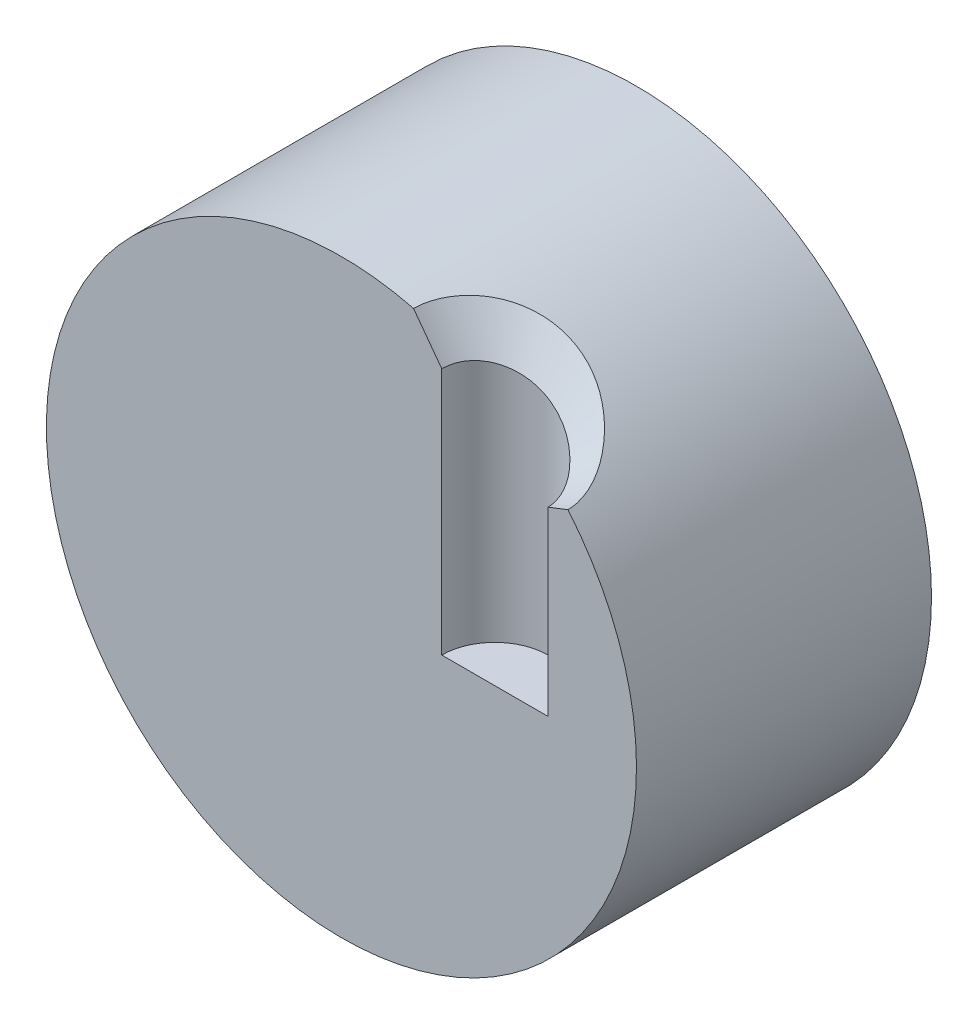
ISO-10303-21;
HEADER;
FILE_DESCRIPTION(('STEP AP214'),'2;1');
FILE_NAME('part.step','',(''),(''),'','','');
FILE_SCHEMA(('AUTOMOTIVE_DESIGN { 1 0 10303 214 1 1 1 1 }'));
ENDSEC;
DATA;
#1=APPLICATION_CONTEXT('core data for automotive mechanical design processes');
#2=APPLICATION_PROTOCOL_DEFINITION('international standard','automotive_design',2000,#1);
#3=PRODUCT_CONTEXT('',#1,'mechanical');
#4=PRODUCT('Part','Part','',(#3));
#5=PRODUCT_RELATED_PRODUCT_CATEGORY('part','',(#4));
#6=PRODUCT_DEFINITION_FORMATION('','',#4);
#7=PRODUCT_DEFINITION_CONTEXT('part definition',#1,'design');
#8=PRODUCT_DEFINITION('design','',#6,#7);
#9=PRODUCT_DEFINITION_SHAPE('','',#8);
#10=(LENGTH_UNIT() NAMED_UNIT(*) SI_UNIT(.MILLI.,.METRE.));
#11=(NAMED_UNIT(*) PLANE_ANGLE_UNIT() SI_UNIT($,.RADIAN.));
#12=(NAMED_UNIT(*) SI_UNIT($,.STERADIAN.) SOLID_ANGLE_UNIT());
#13=UNCERTAINTY_MEASURE_WITH_UNIT(LENGTH_MEASURE(1.E-05),#10,'distance_accuracy_value','');
#14=(GEOMETRIC_REPRESENTATION_CONTEXT(3) GLOBAL_UNCERTAINTY_ASSIGNED_CONTEXT((#13)) GLOBAL_UNIT_ASSIGNED_CONTEXT((#10,
#11,#12)) REPRESENTATION_CONTEXT('',''));
#15=CARTESIAN_POINT('',(0.,0.,0.));
#16=DIRECTION('',(0.,0.,1.));
#17=DIRECTION('',(1.,0.,0.));
#18=AXIS2_PLACEMENT_3D('',#15,#16,#17);
#19=CARTESIAN_POINT('',(13.,50.,0.));
#20=DIRECTION('',(0.,-1.,0.));
#21=DIRECTION('',(0.,0.,-1.));
#22=AXIS2_PLACEMENT_3D('',#19,#20,#21);
#23=CYLINDRICAL_SURFACE('',#22,4.5);
#24=CARTESIAN_POINT('',(8.5,21.0106358910175,0.));
#25=CARTESIAN_POINT('',(8.50000000000001,21.0106358910175,-1.28612390350236));
#26=CARTESIAN_POINT('',(9.09323816529307,20.8094444949196,-2.55154337069353));
#27=CARTESIAN_POINT('',(10.8831303615547,20.0266486269932,-4.13590484872952));
#28=CARTESIAN_POINT('',(12.0398328297088,19.4431002105504,-4.51627222838368));
#29=CARTESIAN_POINT('',(14.239533742647,18.0939172948029,-4.47921359309723));
#30=CARTESIAN_POINT('',(15.830108523265,16.89937483969,-3.79497795565792));
#31=CARTESIAN_POINT('',(17.2061424276833,15.6462471624592,-1.9249997936301));
#32=CARTESIAN_POINT('',(17.5,15.3535710713571,-0.649140939737382));
#33=CARTESIAN_POINT('',(17.5,15.3535710713571,0.));
#34=B_SPLINE_CURVE_WITH_KNOTS('',3,(#24,#25,#26,#27,#28,#29,#30,#31,#32,#33),.UNSPECIFIED.,.F.,
.F.,(4,2,1,1,1,1,4),(0.,0.25,0.484211028592382,0.5,0.75,0.875,1.),.UNSPECIFIED.);
#35=CARTESIAN_POINT('',(13.2310791262327,18.711738496122,-4.49406302107787));
#36=VERTEX_POINT('',#35);
#37=CARTESIAN_POINT('',(17.1957301892497,15.6468289441255,-1.62660633806063));
#38=VERTEX_POINT('',#37);
#39=EDGE_CURVE('E216',#36,#38,#34,.T.);
#40=ORIENTED_EDGE('',*,*,#39,.F.);
#41=CARTESIAN_POINT('',(10.0173851670386,20.4052757657333,-3.36957191592992));
#42=CARTESIAN_POINT('',(10.0755083043557,20.3798564706132,-3.4210259435045));
#43=CARTESIAN_POINT('',(10.1347708732192,20.3536309481129,-3.47078720699877));
#44=CARTESIAN_POINT('',(10.2550931805986,20.2997573582393,-3.56665058730731));
#45=CARTESIAN_POINT('',(10.3161439650753,20.2721159858622,-3.61276770065865));
#46=CARTESIAN_POINT('',(10.4398815347203,20.2154647147495,-3.7013826457049));
#47=CARTESIAN_POINT('',(10.502562737756,20.1864592658293,-3.74389112774458));
#48=CARTESIAN_POINT('',(10.6294001316143,20.1271346258118,-3.82533535987878));
#49=CARTESIAN_POINT('',(10.6935531916576,20.0968181202529,-3.86427794726195));
#50=CARTESIAN_POINT('',(10.8231745275909,20.0349240889016,-3.93863263739004));
#51=CARTESIAN_POINT('',(10.8886413571122,20.0033479157285,-3.97404839151366));
#52=CARTESIAN_POINT('',(11.0207318560443,19.9389904458922,-4.04139540063046));
#53=CARTESIAN_POINT('',(11.0873551525855,19.9062095339892,-4.07332775541628));
#54=CARTESIAN_POINT('',(11.2215986027736,19.8394838295998,-4.13373588191841));
#55=CARTESIAN_POINT('',(11.2892189909684,19.8055387606938,-4.16221082531068));
#56=CARTESIAN_POINT('',(11.4253056194733,19.7365777135972,-4.21579281812949));
#57=CARTESIAN_POINT('',(11.4937723680266,19.7015610712394,-4.2408977246567));
#58=CARTESIAN_POINT('',(11.6130142426524,19.6398527594388,-4.28136590214168));
#59=CARTESIAN_POINT('',(11.663650318488,19.6134246084789,-4.29754401183038));
#60=CARTESIAN_POINT('',(11.7704614870806,19.557108761143,-4.32951338380665));
#61=CARTESIAN_POINT('',(11.8266630170407,19.5271479117159,-4.34508797654452));
#62=CARTESIAN_POINT('',(11.9446048822233,19.463641007705,-4.37529760440365));
#63=CARTESIAN_POINT('',(12.0063655744598,19.4300241861386,-4.38970387675811));
#64=CARTESIAN_POINT('',(12.1353759048221,19.3590423674519,-4.41693532781115));
#65=CARTESIAN_POINT('',(12.2026374703481,19.3216049842288,-4.42951535743564));
#66=CARTESIAN_POINT('',(12.3425428002979,19.2428366177202,-4.45242421922151));
#67=CARTESIAN_POINT('',(12.4151881881585,19.2014331536605,-4.46249365267962));
#68=CARTESIAN_POINT('',(12.5656831040575,19.1145933185181,-4.47966804780186));
#69=CARTESIAN_POINT('',(12.6435219482707,19.0690844782845,-4.48650012365));
#70=CARTESIAN_POINT('',(12.8041404697004,18.973911240747,-4.49645381236572));
#71=CARTESIAN_POINT('',(12.8868952114306,18.9241750539192,-4.49929071416994));
#72=CARTESIAN_POINT('',(13.0569836615445,18.8204416463148,-4.50047298291389));
#73=CARTESIAN_POINT('',(13.1442764330653,18.7663737125257,-4.49852333076545));
#74=CARTESIAN_POINT('',(13.2310791262323,18.7117384961222,-4.49406302107789));
#75=B_SPLINE_CURVE_WITH_KNOTS('',3,(#41,#42,#43,#44,#45,#46,#47,#48,#49,#50,#51,#52,#53,#54,#55,
#56,#57,#58,#59,#60,#61,#62,#63,#64,#65,#66,#67,#68,#69,#70,#71,#72,#73,#74),.UNSPECIFIED.,.F.,
.F.,(4,2,2,2,2,2,2,2,2,2,2,2,2,2,2,2,4),(0.,0.245009998115187,0.48895261866808,
0.732148251007908,0.974867360236699,1.21733250790367,1.45972088059012,1.70216721039607,
1.94476698115417,2.12282759160317,2.31947544240834,2.53475152249334,2.76868031461934,
3.02125701162944,3.29243215550944,3.58209442637968,3.8900527707573),.UNSPECIFIED.);
#76=CARTESIAN_POINT('',(10.0173853682608,20.40527567773,-3.36957209404402));
#77=VERTEX_POINT('',#76);
#78=EDGE_CURVE('E208',#77,#36,#75,.T.);
#79=ORIENTED_EDGE('',*,*,#78,.F.);
#80=CARTESIAN_POINT('',(8.5,21.0106358910175,0.));
#81=CARTESIAN_POINT('',(8.49998399260202,21.0106468391827,-0.11973073962423));
#82=CARTESIAN_POINT('',(8.50477785666777,21.0093836784554,-0.239469893160919));
#83=CARTESIAN_POINT('',(8.52387610143971,21.0038977215626,-0.478130405595921));
#84=CARTESIAN_POINT('',(8.53818147182403,20.9996746174107,-0.597051678092112));
#85=CARTESIAN_POINT('',(8.5761550767947,20.987869115546,-0.832978059064181));
#86=CARTESIAN_POINT('',(8.59980434419083,20.9802935193446,-0.949986552309926));
#87=CARTESIAN_POINT('',(8.6562327972585,20.9614744719834,-1.18147152347752));
#88=CARTESIAN_POINT('',(8.68901128635605,20.9502313006541,-1.29594819386239));
#89=CARTESIAN_POINT('',(8.76341637309469,20.9238455119036,-1.52167617842173));
#90=CARTESIAN_POINT('',(8.80505316493573,20.9086983975129,-1.63292360728982));
#91=CARTESIAN_POINT('',(8.89674724092273,20.8744013672264,-1.85130995246987));
#92=CARTESIAN_POINT('',(8.9468082289252,20.8552496897465,-1.95844703603639));
#93=CARTESIAN_POINT('',(9.05482919337047,20.8129671119953,-2.16783410751081));
#94=CARTESIAN_POINT('',(9.11278884496336,20.7898363753612,-2.27008429616954));
#95=CARTESIAN_POINT('',(9.23601429354331,20.739747281541,-2.4690281298699));
#96=CARTESIAN_POINT('',(9.30127721084513,20.712790431878,-2.56572394240742));
#97=CARTESIAN_POINT('',(9.4386776966942,20.6552348362701,-2.75327458148697));
#98=CARTESIAN_POINT('',(9.51082864628252,20.6246289716471,-2.84411744018745));
#99=CARTESIAN_POINT('',(9.62365061380806,20.5762979037097,-2.97550015745759));
#100=CARTESIAN_POINT('',(9.66202811758913,20.5597819804249,-3.0184850448958));
#101=CARTESIAN_POINT('',(9.74025305072158,20.5259941840628,-3.10279800836146));
#102=CARTESIAN_POINT('',(9.780100564965,20.5087222673165,-3.14412598841519));
#103=CARTESIAN_POINT('',(9.86119356565619,20.4734648813318,-3.22508586764697));
#104=CARTESIAN_POINT('',(9.90243932510759,20.4554792726286,-3.26471743214671));
#105=CARTESIAN_POINT('',(9.98626358870742,20.4189030916701,-3.34225221572577));
#106=CARTESIAN_POINT('',(10.0288420561388,20.4003125360809,-3.38015548235034));
#107=CARTESIAN_POINT('',(10.1151852743153,20.3622793067808,-3.45413922157425));
#108=CARTESIAN_POINT('',(10.1589499946799,20.3428366548846,-3.49021974078728));
#109=CARTESIAN_POINT('',(10.2475792287077,20.3031396516976,-3.56053090517776));
#110=CARTESIAN_POINT('',(10.2924437638527,20.2828852845473,-3.59476151418076));
#111=CARTESIAN_POINT('',(10.4357744384048,20.2176596707381,-3.69993254387023));
#112=CARTESIAN_POINT('',(10.5361204305972,20.1712394831024,-3.76745630690658));
#113=CARTESIAN_POINT('',(10.7406879799205,20.074977734583,-3.89357895041721));
#114=CARTESIAN_POINT('',(10.8449099597115,20.0251358000679,-3.95217685399305));
#115=CARTESIAN_POINT('',(11.0564531084448,19.9222020688464,-4.06038673686003));
#116=CARTESIAN_POINT('',(11.1637757877948,19.8691086736988,-4.10999424818849));
#117=CARTESIAN_POINT('',(11.380620783624,19.7599061342607,-4.20016850257938));
#118=CARTESIAN_POINT('',(11.4901430649871,19.7037970380914,-4.24073538984873));
#119=CARTESIAN_POINT('',(11.839173330694,19.5216488424265,-4.35493942336512));
#120=CARTESIAN_POINT('',(12.0814932206612,19.3902818450779,-4.41205726917491));
#121=CARTESIAN_POINT('',(12.5654472260888,19.1164547952843,-4.48565197257035));
#122=CARTESIAN_POINT('',(12.807081816572,18.9740083596239,-4.50217792870442));
#123=CARTESIAN_POINT('',(13.1076264048146,18.7890146835537,-4.49914250445915));
#124=CARTESIAN_POINT('',(13.1694861361662,18.7505123226203,-4.49723263669623));
#125=CARTESIAN_POINT('',(13.2310791262323,18.7117384961222,-4.49406302107788));
#126=B_SPLINE_CURVE_WITH_KNOTS('',3,(#80,#81,#82,#83,#84,#85,#86,#87,#88,#89,#90,#91,#92,#93,
#94,#95,#96,#97,#98,#99,#100,#101,#102,#103,#104,#105,#106,#107,#108,#109,#110,#111,#112,#113,
#114,#115,#116,#117,#118,#119,#120,#121,#122,#123,#124,#125),.UNSPECIFIED.,.F.,.F.,(4,2,2,2,2,2,
2,2,2,2,2,2,2,2,2,2,2,2,2,2,2,2,4),(0.,0.359102074999249,0.718241520640057,1.07665566346091,
1.43504246620682,1.79384395587221,2.15280361352559,2.51174851262697,2.87055237478457,
3.23006802920722,3.40986349727187,3.58966936469852,3.76951054325441,3.94934677141447,
4.12917839823574,4.30901354034173,4.69720167658858,5.08543226794369,5.47385527263958,
5.86227208115898,6.70311708582155,7.54294453144893,7.76155252910822),.UNSPECIFIED.);
#127=CARTESIAN_POINT('',(8.5,21.0106358910175,0.));
#128=VERTEX_POINT('',#127);
#129=EDGE_CURVE('E13',#128,#77,#126,.T.);
#130=ORIENTED_EDGE('',*,*,#129,.F.);
#131=DIRECTION('',(0.,-1.,0.));
#132=VECTOR('',#131,1.);
#133=CARTESIAN_POINT('',(8.5,50.,0.));
#134=LINE('',#133,#132);
#135=CARTESIAN_POINT('',(8.5,0.,0.));
#136=VERTEX_POINT('',#135);
#137=EDGE_CURVE('E257',#128,#136,#134,.T.);
#138=ORIENTED_EDGE('',*,*,#137,.T.);
#139=CARTESIAN_POINT('',(13.,0.,0.));
#140=DIRECTION('',(0.,1.,0.));
#141=DIRECTION('',(0.,0.,1.));
#142=AXIS2_PLACEMENT_3D('',#139,#140,#141);
#143=CIRCLE('',#142,4.5);
#144=CARTESIAN_POINT('',(17.5,0.,0.));
#145=VERTEX_POINT('',#144);
#146=EDGE_CURVE('E361',#145,#136,#143,.T.);
#147=ORIENTED_EDGE('',*,*,#146,.F.);
#148=DIRECTION('',(0.,-1.,0.));
#149=VECTOR('',#148,1.);
#150=CARTESIAN_POINT('',(17.5,50.,0.));
#151=LINE('',#150,#149);
#152=CARTESIAN_POINT('',(17.5,15.3535710713571,0.));
#153=VERTEX_POINT('',#152);
#154=EDGE_CURVE('E261',#145,#153,#151,.F.);
#155=ORIENTED_EDGE('',*,*,#154,.T.);
#156=CARTESIAN_POINT('',(17.1957301892497,15.6468289441255,-1.62660633806063));
#157=CARTESIAN_POINT('',(17.2199692276056,15.624237397282,-1.56407854827776));
#158=CARTESIAN_POINT('',(17.2429246923163,15.6027296339733,-1.50065721717568));
#159=CARTESIAN_POINT('',(17.286161509033,15.5620279199958,-1.37216155193047));
#160=CARTESIAN_POINT('',(17.3064421272423,15.5428346043782,-1.30708677000743));
#161=CARTESIAN_POINT('',(17.3442019998283,15.5069271196166,-1.17547670027731));
#162=CARTESIAN_POINT('',(17.3616822736876,15.4902120484185,-1.10894195405486));
#163=CARTESIAN_POINT('',(17.3857053167463,15.4671235586315,-1.00818876026128));
#164=CARTESIAN_POINT('',(17.3933454354469,15.4597593813502,-0.974452827561098));
#165=CARTESIAN_POINT('',(17.4078767354709,15.4457136269567,-0.90669188594628));
#166=CARTESIAN_POINT('',(17.4147682070095,15.4390317853957,-0.872666994601989));
#167=CARTESIAN_POINT('',(17.4277859037594,15.4263717435,-0.804354573325884));
#168=CARTESIAN_POINT('',(17.4339124103298,15.4203932845036,-0.770067144910864));
#169=CARTESIAN_POINT('',(17.4453843834517,15.4091605530476,-0.701254456202856));
#170=CARTESIAN_POINT('',(17.4507300837489,15.4039060638838,-0.666729270340354));
#171=CARTESIAN_POINT('',(17.4606246092194,15.394141850186,-0.597466324032974));
#172=CARTESIAN_POINT('',(17.4651735770027,15.389631992376,-0.562728602784988));
#173=CARTESIAN_POINT('',(17.4734589199193,15.3813774989722,-0.493065733176739));
#174=CARTESIAN_POINT('',(17.4771952978661,15.377632860729,-0.458140585465829));
#175=CARTESIAN_POINT('',(17.4838398157081,15.3709291854552,-0.388128030070211));
#176=CARTESIAN_POINT('',(17.4867477648949,15.3679703293264,-0.35304058691041));
#177=CARTESIAN_POINT('',(17.4917199095224,15.3628584603017,-0.282728631691373));
#178=CARTESIAN_POINT('',(17.4937836621396,15.3607058703829,-0.247504057454272));
#179=CARTESIAN_POINT('',(17.4970518769583,15.3572267865825,-0.176942863862906));
#180=CARTESIAN_POINT('',(17.4982555810435,15.3559010216619,-0.141606173166986));
#181=CARTESIAN_POINT('',(17.4997887197646,15.3540952752404,-0.0708463127006203));
#182=CARTESIAN_POINT('',(17.5001170145696,15.3536163967048,-0.0354230902341227));
#183=CARTESIAN_POINT('',(17.5,15.3535710713571,0.));
#184=B_SPLINE_CURVE_WITH_KNOTS('',3,(#156,#157,#158,#159,#160,#161,#162,#163,#164,#165,#166,
#167,#168,#169,#170,#171,#172,#173,#174,#175,#176,#177,#178,#179,#180,#181,#182,#183),
.UNSPECIFIED.,.F.,.F.,(4,2,2,2,2,2,2,2,2,2,2,2,2,4),(0.,0.212272963286814,0.424604039322181,
0.636857638395131,0.742941173471469,0.848983437092724,0.954986582066547,1.06095792812559,
1.16691028655403,1.27286227813864,1.37883864073862,1.48487052220075,1.59099575380801,
1.69725909897306),.UNSPECIFIED.);
#185=EDGE_CURVE('E316',#38,#153,#184,.T.);
#186=ORIENTED_EDGE('',*,*,#185,.F.);
#187=EDGE_LOOP('',(#40,#79,#130,#138,#147,#155,#186));
#188=FACE_BOUND('',#187,.T.);
#189=ADVANCED_FACE('F199',(#188),#23,.F.);
#190=CARTESIAN_POINT('',(0.,0.,0.));
#191=DIRECTION('',(0.,0.,1.));
#192=DIRECTION('',(1.,0.,0.));
#193=AXIS2_PLACEMENT_3D('',#190,#191,#192);
#194=PLANE('',#193);
#195=DIRECTION('',(0.931351597030646,0.364121137409607,0.));
#196=VECTOR('',#195,1.);
#197=CARTESIAN_POINT('',(17.5,15.3535710713571,0.));
#198=LINE('',#197,#196);
#199=CARTESIAN_POINT('',(19.1956240141954,16.0164920848995,0.));
#200=VERTEX_POINT('',#199);
#201=EDGE_CURVE('E325',#153,#200,#198,.T.);
#202=ORIENTED_EDGE('',*,*,#201,.F.);
#203=ORIENTED_EDGE('',*,*,#154,.F.);
#204=DIRECTION('',(1.,0.,0.));
#205=VECTOR('',#204,1.);
#206=CARTESIAN_POINT('',(13.,0.,0.));
#207=LINE('',#206,#205);
#208=EDGE_CURVE('E224',#136,#145,#207,.T.);
#209=ORIENTED_EDGE('',*,*,#208,.F.);
#210=ORIENTED_EDGE('',*,*,#137,.F.);
#211=DIRECTION('',(0.594746390379792,-0.803913385340864,0.));
#212=VECTOR('',#211,1.);
#213=CARTESIAN_POINT('',(8.5,21.0106358910175,0.));
#214=LINE('',#213,#212);
#215=CARTESIAN_POINT('',(6.10937707945262,24.2420195466685,0.));
#216=VERTEX_POINT('',#215);
#217=EDGE_CURVE('E244',#216,#128,#214,.T.);
#218=ORIENTED_EDGE('',*,*,#217,.F.);
#219=CARTESIAN_POINT('',(0.,0.,0.));
#220=DIRECTION('',(0.,0.,1.));
#221=DIRECTION('',(1.,0.,0.));
#222=AXIS2_PLACEMENT_3D('',#219,#220,#221);
#223=CIRCLE('',#222,25.);
#224=EDGE_CURVE('E262',#216,#200,#223,.T.);
#225=ORIENTED_EDGE('',*,*,#224,.T.);
#226=EDGE_LOOP('',(#202,#203,#209,#210,#218,#225));
#227=FACE_BOUND('',#226,.T.);
#228=ADVANCED_FACE('F260',(#227),#194,.T.);
#229=CARTESIAN_POINT('',(0.,0.,-25.));
#230=DIRECTION('',(0.,0.,1.));
#231=DIRECTION('',(1.,0.,0.));
#232=AXIS2_PLACEMENT_3D('',#229,#230,#231);
#233=PLANE('',#232);
#234=CARTESIAN_POINT('',(0.,0.,-25.));
#235=DIRECTION('',(0.,0.,1.));
#236=DIRECTION('',(1.,0.,0.));
#237=AXIS2_PLACEMENT_3D('',#234,#235,#236);
#238=CIRCLE('',#237,25.);
#239=CARTESIAN_POINT('',(25.,0.,-25.));
#240=VERTEX_POINT('',#239);
#241=EDGE_CURVE('E362',#240,#240,#238,.T.);
#242=ORIENTED_EDGE('',*,*,#241,.F.);
#243=EDGE_LOOP('',(#242));
#244=FACE_BOUND('',#243,.T.);
#245=ADVANCED_FACE('F291',(#244),#233,.F.);
#246=CARTESIAN_POINT('',(0.,0.,25.));
#247=DIRECTION('',(0.,0.,-1.));
#248=DIRECTION('',(-1.,0.,0.));
#249=AXIS2_PLACEMENT_3D('',#246,#247,#248);
#250=CYLINDRICAL_SURFACE('',#249,25.);
#251=ORIENTED_EDGE('',*,*,#241,.T.);
#252=EDGE_LOOP('',(#251));
#253=FACE_BOUND('',#252,.T.);
#254=ORIENTED_EDGE('',*,*,#224,.F.);
#255=CARTESIAN_POINT('',(6.10937707945262,24.2420195466685,0.));
#256=CARTESIAN_POINT('',(6.10937636232811,24.2420108782843,-0.153759224100027));
#257=CARTESIAN_POINT('',(6.11560631322604,24.2404497665684,-0.307453926849467));
#258=CARTESIAN_POINT('',(6.13976201643408,24.2343472614946,-0.613735403346212));
#259=CARTESIAN_POINT('',(6.15767751218139,24.2298084816565,-0.766323030146115));
#260=CARTESIAN_POINT('',(6.20436892686145,24.2178933010379,-1.06921368728482));
#261=CARTESIAN_POINT('',(6.23311100046533,24.2105257420278,-1.21952233421911));
#262=CARTESIAN_POINT('',(6.30074871585792,24.1930109118782,-1.51768335897601));
#263=CARTESIAN_POINT('',(6.33964738623008,24.1828628115676,-1.66553499013301));
#264=CARTESIAN_POINT('',(6.48117339223962,24.1454915748491,-2.13999874829037));
#265=CARTESIAN_POINT('',(6.60296166583096,24.1127119695571,-2.46063889200124));
#266=CARTESIAN_POINT('',(6.88820626651441,24.0327799025102,-3.08139131116357));
#267=CARTESIAN_POINT('',(7.05173532637224,23.9856023241156,-3.38146658289502));
#268=CARTESIAN_POINT('',(7.34061522631351,23.8982817525522,-3.83735861828506));
#269=CARTESIAN_POINT('',(7.45407517102336,23.863203188595,-4.0018205859122));
#270=CARTESIAN_POINT('',(7.6928856720488,23.7872907985469,-4.32054440667042));
#271=CARTESIAN_POINT('',(7.81823595248287,23.7464571059767,-4.47480649631987));
#272=CARTESIAN_POINT('',(8.01446256968668,23.6806492518971,-4.69752704112133));
#273=CARTESIAN_POINT('',(8.08124046380406,23.6579529884357,-4.77032387316584));
#274=CARTESIAN_POINT('',(8.21743252291836,23.6109930424815,-4.9128817679208));
#275=CARTESIAN_POINT('',(8.28684644207188,23.5867295060098,-4.9826431124339));
#276=CARTESIAN_POINT('',(8.42820512611078,23.5365879819738,-5.11894088469154));
#277=CARTESIAN_POINT('',(8.50014984579666,23.5107100232363,-5.18547736998091));
#278=CARTESIAN_POINT('',(8.64623429573976,23.4573803243666,-5.31547170066629));
#279=CARTESIAN_POINT('',(8.72037467410486,23.4299281172677,-5.37892862216297));
#280=CARTESIAN_POINT('',(8.94786989165982,23.3444226790042,-5.56605137599206));
#281=CARTESIAN_POINT('',(9.10446458646964,23.2838669780406,-5.68470312385771));
#282=CARTESIAN_POINT('',(9.42482366899965,23.1560455624242,-5.90779822174033));
#283=CARTESIAN_POINT('',(9.5885875956127,23.0887802789601,-6.0122424837779));
#284=CARTESIAN_POINT('',(9.92196896842249,22.9474900148041,-6.20618887732001));
#285=CARTESIAN_POINT('',(10.0915866947531,22.8734647103312,-6.2956902925342));
#286=CARTESIAN_POINT('',(10.4352291201284,22.7187477003634,-6.45911820580713));
#287=CARTESIAN_POINT('',(10.6092538473765,22.6380559521978,-6.53304460416262));
#288=CARTESIAN_POINT('',(10.9598970544064,22.4703881524205,-6.66473096074245));
#289=CARTESIAN_POINT('',(11.1365097621118,22.3834247678896,-6.72252241706239));
#290=CARTESIAN_POINT('',(11.4911982950383,22.2034211407463,-6.82184783119827));
#291=CARTESIAN_POINT('',(11.6692741037902,22.110380966455,-6.86338197175823));
#292=CARTESIAN_POINT('',(12.0254770688297,21.9186863285462,-6.93009991236434));
#293=CARTESIAN_POINT('',(12.2036042277556,21.8200314897337,-6.95528261834166));
#294=CARTESIAN_POINT('',(12.558550755867,21.6176903723428,-6.98937860637908));
#295=CARTESIAN_POINT('',(12.735370094638,21.5140039771725,-6.99829151124763));
#296=CARTESIAN_POINT('',(13.0868192037874,21.3020507223839,-7.00011441360537));
#297=CARTESIAN_POINT('',(13.2614436115448,21.1937747226085,-6.99299084911024));
#298=CARTESIAN_POINT('',(13.6070096202277,20.9735849401923,-6.9631138098988));
#299=CARTESIAN_POINT('',(13.7779512852328,20.8616712209329,-6.94036060736478));
#300=CARTESIAN_POINT('',(14.1151084348398,20.6350421363209,-6.87954232166395));
#301=CARTESIAN_POINT('',(14.2813252966479,20.520327605866,-6.84148175038894));
#302=CARTESIAN_POINT('',(14.608236567962,20.2889019295164,-6.75061005366761));
#303=CARTESIAN_POINT('',(14.7689307835739,20.1721907137353,-6.69779841092039));
#304=CARTESIAN_POINT('',(15.0945096181432,19.9298677751869,-6.57415362626225));
#305=CARTESIAN_POINT('',(15.2589709286617,19.8041769713794,-6.50236118365598));
#306=CARTESIAN_POINT('',(15.5801976204708,19.5524702842242,-6.34369890311738));
#307=CARTESIAN_POINT('',(15.736962147537,19.4264543664201,-6.25682739647171));
#308=CARTESIAN_POINT('',(16.0425300616954,19.1748911413022,-6.0688050944687));
#309=CARTESIAN_POINT('',(16.191321627283,19.0493447732978,-5.96763386305312));
#310=CARTESIAN_POINT('',(16.4803487050042,18.7998554520532,-5.75200748137698));
#311=CARTESIAN_POINT('',(16.6205840955964,18.6759125216097,-5.63755214248146));
#312=CARTESIAN_POINT('',(16.9088905770787,18.4155261831976,-5.38138581686021));
#313=CARTESIAN_POINT('',(17.0558219013592,18.2794081748816,-5.23805342100472));
#314=CARTESIAN_POINT('',(17.2676620126843,18.0786429509451,-5.01205089379604));
#315=CARTESIAN_POINT('',(17.336864393084,18.012274745766,-4.93486342379162));
#316=CARTESIAN_POINT('',(17.4723953265149,17.880836540053,-4.77694092545638));
#317=CARTESIAN_POINT('',(17.5387238142537,17.8157665690319,-4.69620581661015));
#318=CARTESIAN_POINT('',(17.7332117987146,17.6228962642494,-4.44874596760111));
#319=CARTESIAN_POINT('',(17.8569494115966,17.4973635924923,-4.27668615349015));
#320=CARTESIAN_POINT('',(18.0913038856899,17.2549469036555,-3.91837421510364));
#321=CARTESIAN_POINT('',(18.2019272095578,17.1380586374285,-3.73212915619555));
#322=CARTESIAN_POINT('',(18.45136368007,16.869882436053,-3.26530942639294));
#323=CARTESIAN_POINT('',(18.5830558278319,16.7242211893132,-2.97744511436332));
#324=CARTESIAN_POINT('',(18.7545783542647,16.5309792646566,-2.52601019678825));
#325=CARTESIAN_POINT('',(18.8073454694801,16.4708585253293,-2.37255004945438));
#326=CARTESIAN_POINT('',(18.9038397584001,16.3600188419742,-2.05943804218353));
#327=CARTESIAN_POINT('',(18.947566646174,16.3093001953277,-1.89978598659414));
#328=CARTESIAN_POINT('',(19.0194979027859,16.2253288135366,-1.59922394776124));
#329=CARTESIAN_POINT('',(19.0490425684449,16.1906013448195,-1.45904558965567));
#330=CARTESIAN_POINT('',(19.1005147223075,16.1298454115188,-1.17549687658884));
#331=CARTESIAN_POINT('',(19.1224462653864,16.1038123164487,-1.03212826424442));
#332=CARTESIAN_POINT('',(19.1582921391024,16.0611541565904,-0.741475867285535));
#333=CARTESIAN_POINT('',(19.1721236867302,16.0446262659069,-0.59416721640322));
#334=CARTESIAN_POINT('',(19.1908006264189,16.0222731422711,-0.297942073898168));
#335=CARTESIAN_POINT('',(19.1956309939699,16.0164658039062,-0.149023310598722));
#336=CARTESIAN_POINT('',(19.1956240141953,16.0164920848995,0.));
#337=B_SPLINE_CURVE_WITH_KNOTS('',3,(#255,#256,#257,#258,#259,#260,#261,#262,#263,#264,#265,
#266,#267,#268,#269,#270,#271,#272,#273,#274,#275,#276,#277,#278,#279,#280,#281,#282,#283,#284,
#285,#286,#287,#288,#289,#290,#291,#292,#293,#294,#295,#296,#297,#298,#299,#300,#301,#302,#303,
#304,#305,#306,#307,#308,#309,#310,#311,#312,#313,#314,#315,#316,#317,#318,#319,#320,#321,#322,
#323,#324,#325,#326,#327,#328,#329,#330,#331,#332,#333,#334,#335,#336),.UNSPECIFIED.,.F.,.F.,(4,
2,2,2,2,2,2,2,2,2,2,2,2,2,2,2,2,2,2,2,2,2,2,2,2,2,2,2,2,2,2,2,2,2,2,2,2,2,2,2,4),(0.,
0.461048819353188,0.921693513399151,1.3809099633166,1.84026350313132,2.8699437974262,
3.90143069233946,4.50941995387085,5.11739511218452,5.42140118321605,5.72537897104938,
6.02935133266344,6.33341433223472,6.94939752703808,7.56534116137701,8.18131431270807,
8.79729140706354,9.41205746673121,10.0268166157837,10.6416168939202,11.2564314251212,
11.872533869129,12.4886255842941,13.1045358375522,13.7204676926946,14.3770471078014,
15.0336992291562,15.6912994580749,16.3489090260908,17.0869574455822,17.4561540763297,
17.8253590905083,18.5633746593619,19.3010250125083,20.3420895209265,20.8607739573035,
21.3794747964886,21.8212547602046,22.2627990622545,22.7087806174512,23.1555059276823),.UNSPECIFIED.);
#338=EDGE_CURVE('E249',#216,#200,#337,.T.);
#339=ORIENTED_EDGE('',*,*,#338,.T.);
#340=EDGE_LOOP('',(#254,#339));
#341=FACE_BOUND('',#340,.T.);
#342=ADVANCED_FACE('F360',(#253,#341),#250,.T.);
#343=CARTESIAN_POINT('',(13.,0.,0.));
#344=DIRECTION('',(0.,1.,0.));
#345=DIRECTION('',(0.,0.,1.));
#346=AXIS2_PLACEMENT_3D('',#343,#344,#345);
#347=PLANE('',#346);
#348=ORIENTED_EDGE('',*,*,#146,.T.);
#349=ORIENTED_EDGE('',*,*,#208,.T.);
#350=EDGE_LOOP('',(#348,#349));
#351=FACE_BOUND('',#350,.T.);
#352=ADVANCED_FACE('F201',(#351),#347,.T.);
#353=CARTESIAN_POINT('',(8.5,21.0106358910175,0.));
#354=CARTESIAN_POINT('',(8.50000000000001,21.0106358910175,-1.28612390350236));
#355=CARTESIAN_POINT('',(9.09323816529307,20.8094444949196,-2.55154337069353));
#356=CARTESIAN_POINT('',(10.8831303615547,20.0266486269932,-4.13590484872952));
#357=CARTESIAN_POINT('',(12.0398328297088,19.4431002105504,-4.51627222838368));
#358=CARTESIAN_POINT('',(14.239533742647,18.0939172948029,-4.47921359309723));
#359=CARTESIAN_POINT('',(15.830108523265,16.89937483969,-3.79497795565792));
#360=CARTESIAN_POINT('',(17.2061424276833,15.6462471624592,-1.9249997936301));
#361=CARTESIAN_POINT('',(17.5,15.3535710713571,-0.649140939737382));
#362=CARTESIAN_POINT('',(17.5,15.3535710713571,0.));
#363=CARTESIAN_POINT('',(8.2512192240894,21.3469106444335,0.));
#364=CARTESIAN_POINT('',(8.25121922408941,21.3469106444335,-1.34947446813384));
#365=CARTESIAN_POINT('',(8.880408560741,21.1430732665275,-2.6824713751348));
#366=CARTESIAN_POINT('',(10.768028270756,20.3395681047527,-4.36634468317098));
#367=CARTESIAN_POINT('',(11.9887776093716,19.737789266945,-4.78291436607537));
#368=CARTESIAN_POINT('',(14.3054023748546,18.3259343743218,-4.74759021790436));
#369=CARTESIAN_POINT('',(15.9771987770759,17.0627147036559,-4.00795703365365));
#370=CARTESIAN_POINT('',(17.4135959701791,15.7457803909464,-2.02094076591918));
#371=CARTESIAN_POINT('',(17.7189146342688,15.4391579172698,-0.680558371065076));
#372=CARTESIAN_POINT('',(17.7189146342688,15.4391579172697,0.));
#373=CARTESIAN_POINT('',(7.75365767226821,22.0194601512655,0.));
#374=CARTESIAN_POINT('',(7.75365767226822,22.0194601512655,-1.47617559739682));
#375=CARTESIAN_POINT('',(8.45474935163687,21.8103308097434,-2.94432738401734));
#376=CARTESIAN_POINT('',(10.5378240891586,20.9654070602717,-4.8272243520539));
#377=CARTESIAN_POINT('',(11.8866671686971,20.3271673797344,-5.31619864145876));
#378=CARTESIAN_POINT('',(14.4371396392698,18.7899685333595,-5.28434346751863));
#379=CARTESIAN_POINT('',(16.2713792846979,17.3893944315878,-4.43391518964513));
#380=CARTESIAN_POINT('',(17.8285030551708,15.944846847921,-2.21282271049734));
#381=CARTESIAN_POINT('',(18.1567439028065,15.6103316090951,-0.743393233720463));
#382=CARTESIAN_POINT('',(18.1567439028065,15.6103316090951,0.));
#383=CARTESIAN_POINT('',(7.00731534453641,23.0282844115134,0.));
#384=CARTESIAN_POINT('',(7.00731534453642,23.0282844115135,-1.66680882511734));
#385=CARTESIAN_POINT('',(7.81626053798067,22.8112171245671,-3.33772434769218));
#386=CARTESIAN_POINT('',(10.1925178167625,21.9041654935501,-5.51890177069317));
#387=CARTESIAN_POINT('',(11.7335015076853,21.2112345489184,-6.11619850242608));
#388=CARTESIAN_POINT('',(14.6347455358927,19.4860197719159,-6.08937683540322));
#389=CARTESIAN_POINT('',(16.7126500461307,17.8794140234856,-5.0729313853278));
#390=CARTESIAN_POINT('',(18.4508636826583,16.2434465333828,-2.50084171961186));
#391=CARTESIAN_POINT('',(18.8134878056129,15.8670921468331,-0.837753741206757));
#392=CARTESIAN_POINT('',(18.813487805613,15.8670921468331,0.));
#393=CARTESIAN_POINT('',(6.26097301680461,24.0371086717614,0.));
#394=CARTESIAN_POINT('',(6.26097301680462,24.0371086717615,-1.85766154318773));
#395=CARTESIAN_POINT('',(7.17777172432446,23.8121034393908,-3.73135252279182));
#396=CARTESIAN_POINT('',(9.84721154436643,22.8429239268286,-6.21071402266655));
#397=CARTESIAN_POINT('',(11.5803358466736,22.0953017181024,-6.91622583781677));
#398=CARTESIAN_POINT('',(14.8323514325155,20.1820710104725,-6.89437409476315));
#399=CARTESIAN_POINT('',(17.1539208075636,18.3694336153834,-5.71197853321701));
#400=CARTESIAN_POINT('',(19.0732243101459,16.5420462188447,-2.78893591393322));
#401=CARTESIAN_POINT('',(19.4702317084195,16.1238526845711,-0.932155638391558));
#402=CARTESIAN_POINT('',(19.4702317084195,16.1238526845711,0.));
#403=CARTESIAN_POINT('',(5.76341146498341,24.7096581785934,0.));
#404=CARTESIAN_POINT('',(5.76341146498342,24.7096581785934,-1.98505930650709));
#405=CARTESIAN_POINT('',(6.75211251522032,24.4793609826067,-3.99394258455583));
#406=CARTESIAN_POINT('',(9.61700736276904,23.4687628823475,-6.67202204295796));
#407=CARTESIAN_POINT('',(11.4782254059991,22.6846798308918,-7.4495977075296));
#408=CARTESIAN_POINT('',(14.9640886969307,20.6461051695102,-7.43101223655956));
#409=CARTESIAN_POINT('',(17.4481013151855,18.6961133433152,-6.13803309580244));
#410=CARTESIAN_POINT('',(19.4881313951376,16.7411126758192,-2.98105461668674));
#411=CARTESIAN_POINT('',(19.9080609769571,16.2950263763964,-0.995120996029533));
#412=CARTESIAN_POINT('',(19.9080609769572,16.2950263763964,0.));
#413=CARTESIAN_POINT('',(5.51463068907282,25.0459329320094,0.));
#414=CARTESIAN_POINT('',(5.51463068907283,25.0459329320094,-2.04875818816676));
#415=CARTESIAN_POINT('',(6.53928291066826,24.8129897542146,-4.12523761543784));
#416=CARTESIAN_POINT('',(9.50190527197035,23.781682360107,-6.90267605310367));
#417=CARTESIAN_POINT('',(11.4271701856618,22.9793688872864,-7.71628364238602));
#418=CARTESIAN_POINT('',(15.0299573291383,20.878122249029,-7.69933130745776));
#419=CARTESIAN_POINT('',(17.5951915689965,18.8594532072812,-6.35106037709516));
#420=CARTESIAN_POINT('',(19.6955849376334,16.8406459043065,-3.0771139680635));
#421=CARTESIAN_POINT('',(20.126975611226,16.3806132223091,-1.02660367484852));
#422=CARTESIAN_POINT('',(20.126975611226,16.3806132223091,0.));
#423=B_SPLINE_SURFACE_WITH_KNOTS('',3,3,((#353,#354,#355,#356,#357,#358,#359,#360,#361,#362),
(#363,#364,#365,#366,#367,#368,#369,#370,#371,#372),(#373,#374,#375,#376,#377,#378,#379,#380,
#381,#382),(#383,#384,#385,#386,#387,#388,#389,#390,#391,#392),(#393,#394,#395,#396,#397,#398,
#399,#400,#401,#402),(#403,#404,#405,#406,#407,#408,#409,#410,#411,#412),(#413,#414,#415,#416,
#417,#418,#419,#420,#421,#422)),.UNSPECIFIED.,.F.,.F.,.F.,(4,1,1,1,4),(4,2,1,1,1,1,4),(0.,
0.0934613454761697,0.186922690952339,0.280384036428509,0.373845381904679),(0.,0.25,
0.484211028592382,0.5,0.75,0.875,1.),.UNSPECIFIED.);
#424=ORIENTED_EDGE('',*,*,#217,.T.);
#425=ORIENTED_EDGE('',*,*,#129,.T.);
#426=ORIENTED_EDGE('',*,*,#78,.T.);
#427=ORIENTED_EDGE('',*,*,#39,.T.);
#428=ORIENTED_EDGE('',*,*,#185,.T.);
#429=ORIENTED_EDGE('',*,*,#201,.T.);
#430=ORIENTED_EDGE('',*,*,#338,.F.);
#431=EDGE_LOOP('',(#424,#425,#426,#427,#428,#429,#430));
#432=FACE_BOUND('',#431,.T.);
#433=ADVANCED_FACE('F246',(#432),#423,.F.);
#434=CLOSED_SHELL('',(#189,#228,#245,#342,#352,#433));
#435=MANIFOLD_SOLID_BREP('B2',#434);
#436=ADVANCED_BREP_SHAPE_REPRESENTATION('',(#18,#435),#14);
#437=SHAPE_DEFINITION_REPRESENTATION(#9,#436);
ENDSEC;
END-ISO-10303-21;
